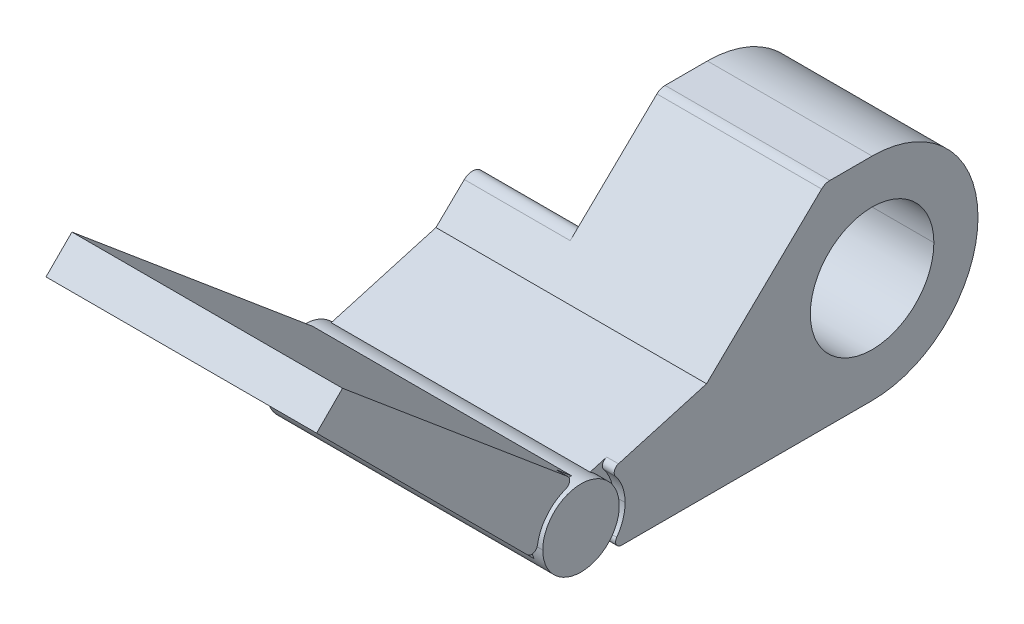
ISO-10303-21;
HEADER;
FILE_DESCRIPTION(('STEP AP214'),'2;1');
FILE_NAME('part.step','',(''),(''),'','','');
FILE_SCHEMA(('AUTOMOTIVE_DESIGN { 1 0 10303 214 1 1 1 1 }'));
ENDSEC;
DATA;
#1=APPLICATION_CONTEXT('core data for automotive mechanical design processes');
#2=APPLICATION_PROTOCOL_DEFINITION('international standard','automotive_design',2000,#1);
#3=PRODUCT_CONTEXT('',#1,'mechanical');
#4=PRODUCT('Part','Part','',(#3));
#5=PRODUCT_RELATED_PRODUCT_CATEGORY('part','',(#4));
#6=PRODUCT_DEFINITION_FORMATION('','',#4);
#7=PRODUCT_DEFINITION_CONTEXT('part definition',#1,'design');
#8=PRODUCT_DEFINITION('design','',#6,#7);
#9=PRODUCT_DEFINITION_SHAPE('','',#8);
#10=(LENGTH_UNIT() NAMED_UNIT(*) SI_UNIT(.MILLI.,.METRE.));
#11=(NAMED_UNIT(*) PLANE_ANGLE_UNIT() SI_UNIT($,.RADIAN.));
#12=(NAMED_UNIT(*) SI_UNIT($,.STERADIAN.) SOLID_ANGLE_UNIT());
#13=UNCERTAINTY_MEASURE_WITH_UNIT(LENGTH_MEASURE(1.E-05),#10,'distance_accuracy_value','');
#14=(GEOMETRIC_REPRESENTATION_CONTEXT(3) GLOBAL_UNCERTAINTY_ASSIGNED_CONTEXT((#13)) GLOBAL_UNIT_ASSIGNED_CONTEXT((#10,
#11,#12)) REPRESENTATION_CONTEXT('',''));
#15=CARTESIAN_POINT('',(0.,0.,0.));
#16=DIRECTION('',(0.,0.,1.));
#17=DIRECTION('',(1.,0.,0.));
#18=AXIS2_PLACEMENT_3D('',#15,#16,#17);
#19=CARTESIAN_POINT('',(23.,17.,3.59597377416485));
#20=DIRECTION('',(-1.,0.,0.));
#21=DIRECTION('',(0.,0.,1.));
#22=AXIS2_PLACEMENT_3D('',#19,#20,#21);
#23=CYLINDRICAL_SURFACE('',#22,1.);
#24=CARTESIAN_POINT('',(23.,17.,3.59597377416485));
#25=DIRECTION('',(1.,0.,0.));
#26=DIRECTION('',(0.,0.,-1.));
#27=AXIS2_PLACEMENT_3D('',#24,#25,#26);
#28=CIRCLE('',#27,1.);
#29=CARTESIAN_POINT('',(23.,18.,3.59597377416485));
#30=VERTEX_POINT('',#29);
#31=CARTESIAN_POINT('',(23.,17.7193398003386,4.29063214462384));
#32=VERTEX_POINT('',#31);
#33=EDGE_CURVE('E328',#30,#32,#28,.T.);
#34=ORIENTED_EDGE('',*,*,#33,.F.);
#35=DIRECTION('',(1.,0.,0.));
#36=VECTOR('',#35,1.);
#37=CARTESIAN_POINT('',(23.,18.,3.59597377416485));
#38=LINE('',#37,#36);
#39=CARTESIAN_POINT('',(9.,18.,3.59597377416485));
#40=VERTEX_POINT('',#39);
#41=EDGE_CURVE('E350',#40,#30,#38,.T.);
#42=ORIENTED_EDGE('',*,*,#41,.F.);
#43=CARTESIAN_POINT('',(9.,17.,3.59597377416485));
#44=DIRECTION('',(-1.,0.,0.));
#45=DIRECTION('',(0.,0.,1.));
#46=AXIS2_PLACEMENT_3D('',#43,#44,#45);
#47=CIRCLE('',#46,1.);
#48=CARTESIAN_POINT('',(9.,17.7193398003386,4.29063214462385));
#49=VERTEX_POINT('',#48);
#50=EDGE_CURVE('E540',#49,#40,#47,.T.);
#51=ORIENTED_EDGE('',*,*,#50,.F.);
#52=DIRECTION('',(-1.,0.,0.));
#53=VECTOR('',#52,1.);
#54=CARTESIAN_POINT('',(23.,17.7193398003386,4.29063214462384));
#55=LINE('',#54,#53);
#56=EDGE_CURVE('E413',#32,#49,#55,.T.);
#57=ORIENTED_EDGE('',*,*,#56,.F.);
#58=EDGE_LOOP('',(#34,#42,#51,#57));
#59=FACE_BOUND('',#58,.T.);
#60=ADVANCED_FACE('F14',(#59),#23,.T.);
#61=CARTESIAN_POINT('',(22.,0.5,21.302643481786));
#62=DIRECTION('',(1.,0.,0.));
#63=DIRECTION('',(0.,0.,-1.));
#64=AXIS2_PLACEMENT_3D('',#61,#62,#63);
#65=CYLINDRICAL_SURFACE('',#64,0.5);
#66=CARTESIAN_POINT('',(22.,0.5,21.302643481786));
#67=DIRECTION('',(-1.,0.,0.));
#68=DIRECTION('',(0.,0.,-1.));
#69=AXIS2_PLACEMENT_3D('',#66,#67,#68);
#70=CIRCLE('',#69,0.5);
#71=CARTESIAN_POINT('',(22.,0.,21.302643481786));
#72=VERTEX_POINT('',#71);
#73=CARTESIAN_POINT('',(22.,0.793724262730775,21.7072742486381));
#74=VERTEX_POINT('',#73);
#75=EDGE_CURVE('E272',#72,#74,#70,.T.);
#76=ORIENTED_EDGE('',*,*,#75,.F.);
#77=DIRECTION('',(-1.,0.,0.));
#78=VECTOR('',#77,1.);
#79=CARTESIAN_POINT('',(22.,0.,21.302643481786));
#80=LINE('',#79,#78);
#81=CARTESIAN_POINT('',(23.,0.,21.302643481786));
#82=VERTEX_POINT('',#81);
#83=EDGE_CURVE('E423',#82,#72,#80,.T.);
#84=ORIENTED_EDGE('',*,*,#83,.F.);
#85=CARTESIAN_POINT('',(23.,0.5,21.302643481786));
#86=DIRECTION('',(1.,0.,0.));
#87=DIRECTION('',(0.,0.,-1.));
#88=AXIS2_PLACEMENT_3D('',#85,#86,#87);
#89=CIRCLE('',#88,0.5);
#90=CARTESIAN_POINT('',(23.,0.793724262730775,21.7072742486381));
#91=VERTEX_POINT('',#90);
#92=EDGE_CURVE('E429',#91,#82,#89,.T.);
#93=ORIENTED_EDGE('',*,*,#92,.F.);
#94=DIRECTION('',(1.,0.,0.));
#95=VECTOR('',#94,1.);
#96=CARTESIAN_POINT('',(22.,0.793724262730776,21.7072742486381));
#97=LINE('',#96,#95);
#98=EDGE_CURVE('E276',#74,#91,#97,.T.);
#99=ORIENTED_EDGE('',*,*,#98,.F.);
#100=EDGE_LOOP('',(#76,#84,#93,#99));
#101=FACE_BOUND('',#100,.T.);
#102=ADVANCED_FACE('F669',(#101),#65,.T.);
#103=CARTESIAN_POINT('',(22.,5.64730748684892,21.4198749707261));
#104=DIRECTION('',(1.,0.,0.));
#105=DIRECTION('',(0.,0.,-1.));
#106=AXIS2_PLACEMENT_3D('',#103,#104,#105);
#107=CYLINDRICAL_SURFACE('',#106,0.5);
#108=CARTESIAN_POINT('',(22.,5.64730748684892,21.4198749707261));
#109=DIRECTION('',(-1.,0.,0.));
#110=DIRECTION('',(0.,0.,-1.));
#111=AXIS2_PLACEMENT_3D('',#108,#109,#110);
#112=CIRCLE('',#111,0.5);
#113=CARTESIAN_POINT('',(22.,5.33546616289159,21.8107137977028));
#114=VERTEX_POINT('',#113);
#115=CARTESIAN_POINT('',(22.,6.12793833481808,21.5576936486347));
#116=VERTEX_POINT('',#115);
#117=EDGE_CURVE('E392',#114,#116,#112,.T.);
#118=ORIENTED_EDGE('',*,*,#117,.F.);
#119=DIRECTION('',(-1.,0.,0.));
#120=VECTOR('',#119,1.);
#121=CARTESIAN_POINT('',(22.,5.33546616289159,21.8107137977028));
#122=LINE('',#121,#120);
#123=CARTESIAN_POINT('',(23.,5.33546616289159,21.8107137977028));
#124=VERTEX_POINT('',#123);
#125=EDGE_CURVE('E293',#124,#114,#122,.T.);
#126=ORIENTED_EDGE('',*,*,#125,.F.);
#127=CARTESIAN_POINT('',(23.,5.64730748684892,21.4198749707261));
#128=DIRECTION('',(1.,0.,0.));
#129=DIRECTION('',(0.,0.,-1.));
#130=AXIS2_PLACEMENT_3D('',#127,#128,#129);
#131=CIRCLE('',#130,0.5);
#132=CARTESIAN_POINT('',(23.,6.12793833481808,21.5576936486347));
#133=VERTEX_POINT('',#132);
#134=EDGE_CURVE('E332',#133,#124,#131,.T.);
#135=ORIENTED_EDGE('',*,*,#134,.F.);
#136=DIRECTION('',(1.,0.,0.));
#137=VECTOR('',#136,1.);
#138=CARTESIAN_POINT('',(23.,6.12793833481808,21.5576936486347));
#139=LINE('',#138,#137);
#140=EDGE_CURVE('E422',#116,#133,#139,.T.);
#141=ORIENTED_EDGE('',*,*,#140,.F.);
#142=EDGE_LOOP('',(#118,#126,#135,#141));
#143=FACE_BOUND('',#142,.T.);
#144=ADVANCED_FACE('F675',(#143),#107,.T.);
#145=CARTESIAN_POINT('',(22.,3.64878220999846,28.9416754288119));
#146=DIRECTION('',(1.,0.,0.));
#147=DIRECTION('',(0.,0.,-1.));
#148=AXIS2_PLACEMENT_3D('',#145,#146,#147);
#149=CYLINDRICAL_SURFACE('',#148,0.5);
#150=CARTESIAN_POINT('',(23.,3.64878220999846,28.9416754288119));
#151=DIRECTION('',(1.,0.,0.));
#152=DIRECTION('',(0.,0.,-1.));
#153=AXIS2_PLACEMENT_3D('',#150,#151,#152);
#154=CIRCLE('',#153,0.5);
#155=CARTESIAN_POINT('',(23.,3.29522881940518,29.2952288194051));
#156=VERTEX_POINT('',#155);
#157=CARTESIAN_POINT('',(23.,3.57206150684706,28.4475965548373));
#158=VERTEX_POINT('',#157);
#159=EDGE_CURVE('E377',#156,#158,#154,.T.);
#160=ORIENTED_EDGE('',*,*,#159,.F.);
#161=DIRECTION('',(1.,0.,0.));
#162=VECTOR('',#161,1.);
#163=CARTESIAN_POINT('',(23.,3.29522881940518,29.2952288194051));
#164=LINE('',#163,#162);
#165=CARTESIAN_POINT('',(22.,3.29522881940518,29.2952288194051));
#166=VERTEX_POINT('',#165);
#167=EDGE_CURVE('E505',#166,#156,#164,.T.);
#168=ORIENTED_EDGE('',*,*,#167,.F.);
#169=CARTESIAN_POINT('',(22.,3.64878220999846,28.9416754288119));
#170=DIRECTION('',(-1.,0.,0.));
#171=DIRECTION('',(0.,0.,-1.));
#172=AXIS2_PLACEMENT_3D('',#169,#170,#171);
#173=CIRCLE('',#172,0.5);
#174=CARTESIAN_POINT('',(22.,3.57206150684706,28.4475965548373));
#175=VERTEX_POINT('',#174);
#176=EDGE_CURVE('E9',#175,#166,#173,.T.);
#177=ORIENTED_EDGE('',*,*,#176,.F.);
#178=DIRECTION('',(-1.,0.,0.));
#179=VECTOR('',#178,1.);
#180=CARTESIAN_POINT('',(22.,3.57206150684706,28.4475965548373));
#181=LINE('',#180,#179);
#182=EDGE_CURVE('E391',#158,#175,#181,.T.);
#183=ORIENTED_EDGE('',*,*,#182,.F.);
#184=EDGE_LOOP('',(#160,#168,#177,#183));
#185=FACE_BOUND('',#184,.T.);
#186=ADVANCED_FACE('F688',(#185),#149,.T.);
#187=CARTESIAN_POINT('',(22.,6.98529548453996,26.2094030110542));
#188=DIRECTION('',(1.,0.,0.));
#189=DIRECTION('',(0.,0.,-1.));
#190=AXIS2_PLACEMENT_3D('',#187,#188,#189);
#191=CYLINDRICAL_SURFACE('',#190,0.5);
#192=DIRECTION('',(1.,0.,0.));
#193=VECTOR('',#192,1.);
#194=CARTESIAN_POINT('',(22.,6.98529548453996,25.7094030110542));
#195=LINE('',#194,#193);
#196=CARTESIAN_POINT('',(22.,6.98529548453996,25.7094030110542));
#197=VERTEX_POINT('',#196);
#198=CARTESIAN_POINT('',(23.,6.98529548453996,25.7094030110542));
#199=VERTEX_POINT('',#198);
#200=EDGE_CURVE('E440',#197,#199,#195,.T.);
#201=ORIENTED_EDGE('',*,*,#200,.F.);
#202=CARTESIAN_POINT('',(22.,6.98529548453996,26.2094030110542));
#203=DIRECTION('',(-1.,0.,0.));
#204=DIRECTION('',(0.,0.,-1.));
#205=AXIS2_PLACEMENT_3D('',#202,#203,#204);
#206=CIRCLE('',#205,0.5);
#207=CARTESIAN_POINT('',(22.,7.36831770609945,25.8880092062109));
#208=VERTEX_POINT('',#207);
#209=EDGE_CURVE('E25',#208,#197,#206,.T.);
#210=ORIENTED_EDGE('',*,*,#209,.F.);
#211=DIRECTION('',(-1.,0.,0.));
#212=VECTOR('',#211,1.);
#213=CARTESIAN_POINT('',(22.,7.36831770609945,25.8880092062109));
#214=LINE('',#213,#212);
#215=CARTESIAN_POINT('',(23.,7.36831770609944,25.8880092062109));
#216=VERTEX_POINT('',#215);
#217=EDGE_CURVE('E433',#216,#208,#214,.T.);
#218=ORIENTED_EDGE('',*,*,#217,.F.);
#219=CARTESIAN_POINT('',(23.,6.98529548453996,26.2094030110542));
#220=DIRECTION('',(1.,0.,0.));
#221=DIRECTION('',(0.,0.,-1.));
#222=AXIS2_PLACEMENT_3D('',#219,#220,#221);
#223=CIRCLE('',#222,0.5);
#224=EDGE_CURVE('E343',#199,#216,#223,.T.);
#225=ORIENTED_EDGE('',*,*,#224,.F.);
#226=EDGE_LOOP('',(#201,#210,#218,#225));
#227=FACE_BOUND('',#226,.T.);
#228=ADVANCED_FACE('F690',(#227),#191,.T.);
#229=CARTESIAN_POINT('',(22.,2.99665623321162,24.7420050000283));
#230=DIRECTION('',(1.,0.,0.));
#231=DIRECTION('',(0.,1.,0.));
#232=AXIS2_PLACEMENT_3D('',#229,#230,#231);
#233=PLANE('',#232);
#234=DIRECTION('',(0.,-0.642787609686543,-0.766044443118975));
#235=VECTOR('',#234,1.);
#236=CARTESIAN_POINT('',(22.,-8.42344976404674,7.06811359025203));
#237=LINE('',#236,#235);
#238=CARTESIAN_POINT('',(22.,6.24062355295245,24.5440756478505));
#239=VERTEX_POINT('',#238);
#240=EDGE_CURVE('E317',#208,#239,#237,.T.);
#241=ORIENTED_EDGE('',*,*,#240,.F.);
#242=ORIENTED_EDGE('',*,*,#209,.T.);
#243=CARTESIAN_POINT('',(22.,6.98529548453996,26.2094030110542));
#244=DIRECTION('',(-1.,0.,0.));
#245=DIRECTION('',(0.,0.,-1.));
#246=AXIS2_PLACEMENT_3D('',#243,#244,#245);
#247=CIRCLE('',#246,0.5);
#248=CARTESIAN_POINT('',(22.,6.5160438079131,26.0367679509335));
#249=VERTEX_POINT('',#248);
#250=EDGE_CURVE('E18',#197,#249,#247,.T.);
#251=ORIENTED_EDGE('',*,*,#250,.T.);
#252=CARTESIAN_POINT('',(22.,2.99665623321162,24.7420050000283));
#253=DIRECTION('',(1.,0.,0.));
#254=DIRECTION('',(0.,0.,-1.));
#255=AXIS2_PLACEMENT_3D('',#252,#253,#254);
#256=CIRCLE('',#255,3.75);
#257=EDGE_CURVE('E387',#249,#175,#256,.T.);
#258=ORIENTED_EDGE('',*,*,#257,.T.);
#259=ORIENTED_EDGE('',*,*,#176,.T.);
#260=DIRECTION('',(0.,0.707106781186549,0.707106781186546));
#261=VECTOR('',#260,1.);
#262=CARTESIAN_POINT('',(22.,-13.,13.));
#263=LINE('',#262,#261);
#264=CARTESIAN_POINT('',(22.,1.73866123323988,27.7386612332399));
#265=VERTEX_POINT('',#264);
#266=EDGE_CURVE('E504',#265,#166,#263,.T.);
#267=ORIENTED_EDGE('',*,*,#266,.F.);
#268=CARTESIAN_POINT('',(22.,2.99665623321162,24.7420050000283));
#269=DIRECTION('',(1.,0.,0.));
#270=DIRECTION('',(0.,0.,-1.));
#271=AXIS2_PLACEMENT_3D('',#268,#269,#270);
#272=CIRCLE('',#271,3.25);
#273=CARTESIAN_POINT('',(22.,2.99665623321162,27.9920050000283));
#274=VERTEX_POINT('',#273);
#275=EDGE_CURVE('E380',#274,#265,#272,.T.);
#276=ORIENTED_EDGE('',*,*,#275,.F.);
#277=CARTESIAN_POINT('',(22.,2.99665623321162,24.7420050000283));
#278=DIRECTION('',(1.,0.,0.));
#279=DIRECTION('',(0.,0.,-1.));
#280=AXIS2_PLACEMENT_3D('',#277,#278,#279);
#281=CIRCLE('',#280,3.25);
#282=EDGE_CURVE('E512',#239,#274,#281,.T.);
#283=ORIENTED_EDGE('',*,*,#282,.F.);
#284=EDGE_LOOP('',(#241,#242,#251,#258,#259,#267,#276,#283));
#285=FACE_BOUND('',#284,.T.);
#286=ADVANCED_FACE('F715',(#285),#233,.T.);
#287=CARTESIAN_POINT('',(22.,2.99665623321162,24.7420050000283));
#288=DIRECTION('',(1.,0.,0.));
#289=DIRECTION('',(0.,0.,-1.));
#290=AXIS2_PLACEMENT_3D('',#287,#288,#289);
#291=CYLINDRICAL_SURFACE('',#290,3.75);
#292=ORIENTED_EDGE('',*,*,#257,.F.);
#293=DIRECTION('',(1.,0.,0.));
#294=VECTOR('',#293,1.);
#295=CARTESIAN_POINT('',(22.,6.5160438079131,26.0367679509335));
#296=LINE('',#295,#294);
#297=CARTESIAN_POINT('',(23.,6.5160438079131,26.0367679509335));
#298=VERTEX_POINT('',#297);
#299=EDGE_CURVE('E295',#249,#298,#296,.T.);
#300=ORIENTED_EDGE('',*,*,#299,.T.);
#301=CARTESIAN_POINT('',(23.,2.99665623321162,24.7420050000283));
#302=DIRECTION('',(1.,0.,0.));
#303=DIRECTION('',(0.,0.,-1.));
#304=AXIS2_PLACEMENT_3D('',#301,#302,#303);
#305=CIRCLE('',#304,3.75);
#306=EDGE_CURVE('E339',#298,#158,#305,.T.);
#307=ORIENTED_EDGE('',*,*,#306,.T.);
#308=ORIENTED_EDGE('',*,*,#182,.T.);
#309=EDGE_LOOP('',(#292,#300,#307,#308));
#310=FACE_BOUND('',#309,.T.);
#311=ADVANCED_FACE('F703',(#310),#291,.F.);
#312=CARTESIAN_POINT('',(22.,2.99665623321162,24.7420050000283));
#313=DIRECTION('',(1.,0.,0.));
#314=DIRECTION('',(0.,1.,0.));
#315=AXIS2_PLACEMENT_3D('',#312,#313,#314);
#316=PLANE('',#315);
#317=DIRECTION('',(0.,-0.275637355817,0.961261695938319));
#318=VECTOR('',#317,1.);
#319=CARTESIAN_POINT('',(22.,11.3742809649369,3.26152258301993));
#320=LINE('',#319,#318);
#321=CARTESIAN_POINT('',(22.,5.7223893692874,22.9720109687111));
#322=VERTEX_POINT('',#321);
#323=EDGE_CURVE('E587',#116,#322,#320,.T.);
#324=ORIENTED_EDGE('',*,*,#323,.T.);
#325=CARTESIAN_POINT('',(22.,2.99665623321162,24.7420050000283));
#326=DIRECTION('',(1.,0.,0.));
#327=DIRECTION('',(0.,0.,-1.));
#328=AXIS2_PLACEMENT_3D('',#325,#326,#327);
#329=CIRCLE('',#328,3.25);
#330=CARTESIAN_POINT('',(22.,2.99665623321162,21.4920050000283));
#331=VERTEX_POINT('',#330);
#332=EDGE_CURVE('E366',#331,#322,#329,.T.);
#333=ORIENTED_EDGE('',*,*,#332,.F.);
#334=CARTESIAN_POINT('',(22.,2.99665623321162,24.7420050000283));
#335=DIRECTION('',(1.,0.,0.));
#336=DIRECTION('',(0.,0.,-1.));
#337=AXIS2_PLACEMENT_3D('',#334,#335,#336);
#338=CIRCLE('',#337,3.25);
#339=CARTESIAN_POINT('',(22.,0.,23.4840100000565));
#340=VERTEX_POINT('',#339);
#341=EDGE_CURVE('E320',#340,#331,#338,.T.);
#342=ORIENTED_EDGE('',*,*,#341,.F.);
#343=DIRECTION('',(0.,0.,1.));
#344=VECTOR('',#343,1.);
#345=CARTESIAN_POINT('',(22.,0.,0.));
#346=LINE('',#345,#344);
#347=EDGE_CURVE('E427',#72,#340,#346,.T.);
#348=ORIENTED_EDGE('',*,*,#347,.F.);
#349=ORIENTED_EDGE('',*,*,#75,.T.);
#350=CARTESIAN_POINT('',(22.,2.99665623321162,24.7420050000283));
#351=DIRECTION('',(1.,0.,0.));
#352=DIRECTION('',(0.,0.,-1.));
#353=AXIS2_PLACEMENT_3D('',#350,#351,#352);
#354=CIRCLE('',#353,3.75);
#355=CARTESIAN_POINT('',(22.,2.99665623321162,20.9920050000283));
#356=VERTEX_POINT('',#355);
#357=EDGE_CURVE('E265',#74,#356,#354,.T.);
#358=ORIENTED_EDGE('',*,*,#357,.T.);
#359=CARTESIAN_POINT('',(22.,2.99665623321162,24.7420050000283));
#360=DIRECTION('',(1.,0.,0.));
#361=DIRECTION('',(0.,0.,-1.));
#362=AXIS2_PLACEMENT_3D('',#359,#360,#361);
#363=CIRCLE('',#362,3.75);
#364=EDGE_CURVE('E269',#356,#114,#363,.T.);
#365=ORIENTED_EDGE('',*,*,#364,.T.);
#366=ORIENTED_EDGE('',*,*,#117,.T.);
#367=EDGE_LOOP('',(#324,#333,#342,#348,#349,#358,#365,#366));
#368=FACE_BOUND('',#367,.T.);
#369=ADVANCED_FACE('F267',(#368),#316,.T.);
#370=CARTESIAN_POINT('',(22.,2.99665623321162,24.7420050000283));
#371=DIRECTION('',(1.,0.,0.));
#372=DIRECTION('',(0.,0.,-1.));
#373=AXIS2_PLACEMENT_3D('',#370,#371,#372);
#374=CYLINDRICAL_SURFACE('',#373,3.75);
#375=DIRECTION('',(1.,0.,0.));
#376=VECTOR('',#375,1.);
#377=CARTESIAN_POINT('',(22.,2.99665623321162,20.9920050000283));
#378=LINE('',#377,#376);
#379=CARTESIAN_POINT('',(23.,2.99665623321162,20.9920050000283));
#380=VERTEX_POINT('',#379);
#381=EDGE_CURVE('E280',#356,#380,#378,.T.);
#382=ORIENTED_EDGE('',*,*,#381,.F.);
#383=ORIENTED_EDGE('',*,*,#357,.F.);
#384=ORIENTED_EDGE('',*,*,#98,.T.);
#385=CARTESIAN_POINT('',(23.,2.99665623321162,24.7420050000283));
#386=DIRECTION('',(1.,0.,0.));
#387=DIRECTION('',(0.,0.,-1.));
#388=AXIS2_PLACEMENT_3D('',#385,#386,#387);
#389=CIRCLE('',#388,3.75);
#390=EDGE_CURVE('E283',#91,#380,#389,.T.);
#391=ORIENTED_EDGE('',*,*,#390,.T.);
#392=EDGE_LOOP('',(#382,#383,#384,#391));
#393=FACE_BOUND('',#392,.T.);
#394=ADVANCED_FACE('F281',(#393),#374,.F.);
#395=CARTESIAN_POINT('',(-0.5,2.99665623321162,24.7420050000283));
#396=DIRECTION('',(-1.,0.,0.));
#397=DIRECTION('',(0.,0.,1.));
#398=AXIS2_PLACEMENT_3D('',#395,#396,#397);
#399=PLANE('',#398);
#400=CARTESIAN_POINT('',(-0.5,2.99665623321162,24.7420050000283));
#401=DIRECTION('',(-1.,0.,0.));
#402=DIRECTION('',(0.,0.,1.));
#403=AXIS2_PLACEMENT_3D('',#400,#401,#402);
#404=CIRCLE('',#403,3.25);
#405=CARTESIAN_POINT('',(-0.5,2.99665623321162,27.9920050000283));
#406=VERTEX_POINT('',#405);
#407=CARTESIAN_POINT('',(-0.5,2.99665623321162,21.4920050000283));
#408=VERTEX_POINT('',#407);
#409=EDGE_CURVE('E498',#406,#408,#404,.T.);
#410=ORIENTED_EDGE('',*,*,#409,.T.);
#411=CARTESIAN_POINT('',(-0.5,2.99665623321162,24.7420050000283));
#412=DIRECTION('',(-1.,0.,0.));
#413=DIRECTION('',(0.,0.,1.));
#414=AXIS2_PLACEMENT_3D('',#411,#412,#413);
#415=CIRCLE('',#414,3.25);
#416=EDGE_CURVE('E321',#408,#406,#415,.T.);
#417=ORIENTED_EDGE('',*,*,#416,.T.);
#418=EDGE_LOOP('',(#410,#417));
#419=FACE_BOUND('',#418,.T.);
#420=ADVANCED_FACE('F700',(#419),#399,.T.);
#421=CARTESIAN_POINT('',(9.,9.88440397573025,10.9643891579838));
#422=DIRECTION('',(-1.,0.,0.));
#423=DIRECTION('',(0.,0.,1.));
#424=AXIS2_PLACEMENT_3D('',#421,#422,#423);
#425=CYLINDRICAL_SURFACE('',#424,1.);
#426=CARTESIAN_POINT('',(9.,9.88440397573025,10.9643891579838));
#427=DIRECTION('',(1.,0.,0.));
#428=DIRECTION('',(0.,0.,1.));
#429=AXIS2_PLACEMENT_3D('',#426,#427,#428);
#430=CIRCLE('',#429,1.);
#431=CARTESIAN_POINT('',(9.,9.80400361430023,9.96762650725799));
#432=VERTEX_POINT('',#431);
#433=CARTESIAN_POINT('',(9.,10.6037437760689,11.6590475284428));
#434=VERTEX_POINT('',#433);
#435=EDGE_CURVE('E277',#432,#434,#430,.T.);
#436=ORIENTED_EDGE('',*,*,#435,.F.);
#437=DIRECTION('',(1.,0.,0.));
#438=VECTOR('',#437,1.);
#439=CARTESIAN_POINT('',(9.,9.80400361430023,9.96762650725799));
#440=LINE('',#439,#438);
#441=CARTESIAN_POINT('',(0.,9.80400361430023,9.96762650725799));
#442=VERTEX_POINT('',#441);
#443=EDGE_CURVE('E381',#442,#432,#440,.T.);
#444=ORIENTED_EDGE('',*,*,#443,.F.);
#445=CARTESIAN_POINT('',(0.,9.88440397573025,10.9643891579838));
#446=DIRECTION('',(-1.,0.,0.));
#447=DIRECTION('',(0.,0.,-1.));
#448=AXIS2_PLACEMENT_3D('',#445,#446,#447);
#449=CIRCLE('',#448,1.);
#450=CARTESIAN_POINT('',(0.,10.6037437760689,11.6590475284428));
#451=VERTEX_POINT('',#450);
#452=EDGE_CURVE('E453',#451,#442,#449,.T.);
#453=ORIENTED_EDGE('',*,*,#452,.F.);
#454=DIRECTION('',(-1.,0.,0.));
#455=VECTOR('',#454,1.);
#456=CARTESIAN_POINT('',(23.,10.6037437760689,11.6590475284428));
#457=LINE('',#456,#455);
#458=EDGE_CURVE('E333',#434,#451,#457,.T.);
#459=ORIENTED_EDGE('',*,*,#458,.F.);
#460=EDGE_LOOP('',(#436,#444,#453,#459));
#461=FACE_BOUND('',#460,.T.);
#462=ADVANCED_FACE('F687',(#461),#425,.T.);
#463=CARTESIAN_POINT('',(9.,1.,7.54983443527075));
#464=DIRECTION('',(-1.,0.,0.));
#465=DIRECTION('',(0.,0.,1.));
#466=AXIS2_PLACEMENT_3D('',#463,#464,#465);
#467=CYLINDRICAL_SURFACE('',#466,1.);
#468=CARTESIAN_POINT('',(9.,1.,7.54983443527075));
#469=DIRECTION('',(1.,0.,0.));
#470=DIRECTION('',(0.,0.,1.));
#471=AXIS2_PLACEMENT_3D('',#468,#469,#470);
#472=CIRCLE('',#471,1.);
#473=CARTESIAN_POINT('',(9.,0.,7.54983443527075));
#474=VERTEX_POINT('',#473);
#475=CARTESIAN_POINT('',(9.,1.72727272727273,6.86348585024614));
#476=VERTEX_POINT('',#475);
#477=EDGE_CURVE('E537',#474,#476,#472,.T.);
#478=ORIENTED_EDGE('',*,*,#477,.F.);
#479=DIRECTION('',(1.,0.,0.));
#480=VECTOR('',#479,1.);
#481=CARTESIAN_POINT('',(9.,0.,7.54983443527075));
#482=LINE('',#481,#480);
#483=CARTESIAN_POINT('',(0.,0.,7.54983443527075));
#484=VERTEX_POINT('',#483);
#485=EDGE_CURVE('E170',#484,#474,#482,.T.);
#486=ORIENTED_EDGE('',*,*,#485,.F.);
#487=CARTESIAN_POINT('',(0.,1.,7.54983443527075));
#488=DIRECTION('',(-1.,0.,0.));
#489=DIRECTION('',(0.,0.,-1.));
#490=AXIS2_PLACEMENT_3D('',#487,#488,#489);
#491=CIRCLE('',#490,1.);
#492=CARTESIAN_POINT('',(0.,1.72727272727273,6.86348585024614));
#493=VERTEX_POINT('',#492);
#494=EDGE_CURVE('E494',#493,#484,#491,.T.);
#495=ORIENTED_EDGE('',*,*,#494,.F.);
#496=DIRECTION('',(-1.,0.,0.));
#497=VECTOR('',#496,1.);
#498=CARTESIAN_POINT('',(9.,1.72727272727273,6.86348585024614));
#499=LINE('',#498,#497);
#500=EDGE_CURVE('E183',#476,#493,#499,.T.);
#501=ORIENTED_EDGE('',*,*,#500,.F.);
#502=EDGE_LOOP('',(#478,#486,#495,#501));
#503=FACE_BOUND('',#502,.T.);
#504=ADVANCED_FACE('F683',(#503),#467,.T.);
#505=CARTESIAN_POINT('',(9.,0.,0.));
#506=DIRECTION('',(-1.,0.,0.));
#507=DIRECTION('',(0.,0.,1.));
#508=AXIS2_PLACEMENT_3D('',#505,#506,#507);
#509=PLANE('',#508);
#510=CARTESIAN_POINT('',(9.,9.,0.));
#511=DIRECTION('',(1.,0.,0.));
#512=DIRECTION('',(0.,0.,1.));
#513=AXIS2_PLACEMENT_3D('',#510,#511,#512);
#514=CIRCLE('',#513,5.25);
#515=CARTESIAN_POINT('',(9.,9.,5.25));
#516=VERTEX_POINT('',#515);
#517=CARTESIAN_POINT('',(9.,9.,-5.25));
#518=VERTEX_POINT('',#517);
#519=EDGE_CURVE('E441',#516,#518,#514,.T.);
#520=ORIENTED_EDGE('',*,*,#519,.T.);
#521=CARTESIAN_POINT('',(9.,9.,0.));
#522=DIRECTION('',(1.,0.,0.));
#523=DIRECTION('',(0.,0.,1.));
#524=AXIS2_PLACEMENT_3D('',#521,#522,#523);
#525=CIRCLE('',#524,5.25);
#526=EDGE_CURVE('E353',#518,#516,#525,.T.);
#527=ORIENTED_EDGE('',*,*,#526,.T.);
#528=EDGE_LOOP('',(#520,#527));
#529=FACE_BOUND('',#528,.T.);
#530=DIRECTION('',(0.,0.694658370458999,-0.71933980033865));
#531=VECTOR('',#530,1.);
#532=CARTESIAN_POINT('',(9.,11.3128771243607,10.9247184497669));
#533=LINE('',#532,#531);
#534=EDGE_CURVE('E404',#434,#49,#533,.T.);
#535=ORIENTED_EDGE('',*,*,#534,.T.);
#536=ORIENTED_EDGE('',*,*,#50,.T.);
#537=DIRECTION('',(0.,0.,-1.));
#538=VECTOR('',#537,1.);
#539=CARTESIAN_POINT('',(9.,18.,0.));
#540=LINE('',#539,#538);
#541=CARTESIAN_POINT('',(9.,18.,0.));
#542=VERTEX_POINT('',#541);
#543=EDGE_CURVE('E398',#40,#542,#540,.T.);
#544=ORIENTED_EDGE('',*,*,#543,.T.);
#545=CARTESIAN_POINT('',(9.,9.,0.));
#546=DIRECTION('',(-1.,0.,0.));
#547=DIRECTION('',(0.,0.,1.));
#548=AXIS2_PLACEMENT_3D('',#545,#546,#547);
#549=CIRCLE('',#548,9.);
#550=CARTESIAN_POINT('',(9.,0.,0.));
#551=VERTEX_POINT('',#550);
#552=EDGE_CURVE('E322',#542,#551,#549,.T.);
#553=ORIENTED_EDGE('',*,*,#552,.T.);
#554=DIRECTION('',(0.,0.,1.));
#555=VECTOR('',#554,1.);
#556=CARTESIAN_POINT('',(9.,0.,0.));
#557=LINE('',#556,#555);
#558=EDGE_CURVE('E354',#551,#474,#557,.T.);
#559=ORIENTED_EDGE('',*,*,#558,.T.);
#560=ORIENTED_EDGE('',*,*,#477,.T.);
#561=CARTESIAN_POINT('',(9.,9.,0.));
#562=DIRECTION('',(-1.,0.,0.));
#563=DIRECTION('',(0.,0.,1.));
#564=AXIS2_PLACEMENT_3D('',#561,#562,#563);
#565=CIRCLE('',#564,10.);
#566=CARTESIAN_POINT('',(9.,9.,10.));
#567=VERTEX_POINT('',#566);
#568=EDGE_CURVE('E432',#476,#567,#565,.T.);
#569=ORIENTED_EDGE('',*,*,#568,.T.);
#570=CARTESIAN_POINT('',(9.,9.,0.));
#571=DIRECTION('',(-1.,0.,0.));
#572=DIRECTION('',(0.,0.,1.));
#573=AXIS2_PLACEMENT_3D('',#570,#571,#572);
#574=CIRCLE('',#573,10.);
#575=EDGE_CURVE('E334',#567,#432,#574,.T.);
#576=ORIENTED_EDGE('',*,*,#575,.T.);
#577=ORIENTED_EDGE('',*,*,#435,.T.);
#578=EDGE_LOOP('',(#535,#536,#544,#553,#559,#560,#569,#576,#577));
#579=FACE_BOUND('',#578,.T.);
#580=ADVANCED_FACE('F686',(#529,#579),#509,.T.);
#581=CARTESIAN_POINT('',(9.,9.,0.));
#582=DIRECTION('',(-1.,0.,0.));
#583=DIRECTION('',(0.,0.,1.));
#584=AXIS2_PLACEMENT_3D('',#581,#582,#583);
#585=CYLINDRICAL_SURFACE('',#584,10.);
#586=DIRECTION('',(-1.,0.,0.));
#587=VECTOR('',#586,1.);
#588=CARTESIAN_POINT('',(9.,9.,10.));
#589=LINE('',#588,#587);
#590=CARTESIAN_POINT('',(0.,9.,10.));
#591=VERTEX_POINT('',#590);
#592=EDGE_CURVE('E338',#567,#591,#589,.T.);
#593=ORIENTED_EDGE('',*,*,#592,.F.);
#594=ORIENTED_EDGE('',*,*,#568,.F.);
#595=ORIENTED_EDGE('',*,*,#500,.T.);
#596=CARTESIAN_POINT('',(0.,9.,0.));
#597=DIRECTION('',(-1.,0.,0.));
#598=DIRECTION('',(0.,0.,1.));
#599=AXIS2_PLACEMENT_3D('',#596,#597,#598);
#600=CIRCLE('',#599,10.);
#601=EDGE_CURVE('E491',#493,#591,#600,.T.);
#602=ORIENTED_EDGE('',*,*,#601,.T.);
#603=EDGE_LOOP('',(#593,#594,#595,#602));
#604=FACE_BOUND('',#603,.T.);
#605=ADVANCED_FACE('F720',(#604),#585,.F.);
#606=CARTESIAN_POINT('',(23.,0.,0.));
#607=DIRECTION('',(1.,0.,0.));
#608=DIRECTION('',(0.,1.,0.));
#609=AXIS2_PLACEMENT_3D('',#606,#607,#608);
#610=PLANE('',#609);
#611=CARTESIAN_POINT('',(23.,9.,0.));
#612=DIRECTION('',(1.,0.,0.));
#613=DIRECTION('',(0.,0.,-1.));
#614=AXIS2_PLACEMENT_3D('',#611,#612,#613);
#615=CIRCLE('',#614,5.25);
#616=CARTESIAN_POINT('',(23.,9.,5.25));
#617=VERTEX_POINT('',#616);
#618=CARTESIAN_POINT('',(23.,9.,-5.25));
#619=VERTEX_POINT('',#618);
#620=EDGE_CURVE('E457',#617,#619,#615,.T.);
#621=ORIENTED_EDGE('',*,*,#620,.F.);
#622=CARTESIAN_POINT('',(23.,9.,0.));
#623=DIRECTION('',(1.,0.,0.));
#624=DIRECTION('',(0.,0.,-1.));
#625=AXIS2_PLACEMENT_3D('',#622,#623,#624);
#626=CIRCLE('',#625,5.25);
#627=EDGE_CURVE('E349',#619,#617,#626,.T.);
#628=ORIENTED_EDGE('',*,*,#627,.F.);
#629=EDGE_LOOP('',(#621,#628));
#630=FACE_BOUND('',#629,.T.);
#631=DIRECTION('',(0.,0.,1.));
#632=VECTOR('',#631,1.);
#633=CARTESIAN_POINT('',(23.,18.,0.));
#634=LINE('',#633,#632);
#635=CARTESIAN_POINT('',(23.,18.,0.));
#636=VERTEX_POINT('',#635);
#637=EDGE_CURVE('E345',#636,#30,#634,.T.);
#638=ORIENTED_EDGE('',*,*,#637,.T.);
#639=ORIENTED_EDGE('',*,*,#33,.T.);
#640=DIRECTION('',(0.,-0.694658370458999,0.71933980033865));
#641=VECTOR('',#640,1.);
#642=CARTESIAN_POINT('',(23.,11.3128771243607,10.9247184497669));
#643=LINE('',#642,#641);
#644=CARTESIAN_POINT('',(23.,8.27478281357402,14.0707572047411));
#645=VERTEX_POINT('',#644);
#646=EDGE_CURVE('E358',#32,#645,#643,.T.);
#647=ORIENTED_EDGE('',*,*,#646,.T.);
#648=DIRECTION('',(0.,-0.275637355817,0.961261695938319));
#649=VECTOR('',#648,1.);
#650=CARTESIAN_POINT('',(23.,11.3742809649369,3.26152258301993));
#651=LINE('',#650,#649);
#652=EDGE_CURVE('E417',#645,#133,#651,.T.);
#653=ORIENTED_EDGE('',*,*,#652,.T.);
#654=ORIENTED_EDGE('',*,*,#134,.T.);
#655=CARTESIAN_POINT('',(23.,2.99665623321162,24.7420050000283));
#656=DIRECTION('',(1.,0.,0.));
#657=DIRECTION('',(0.,0.,-1.));
#658=AXIS2_PLACEMENT_3D('',#655,#656,#657);
#659=CIRCLE('',#658,3.75);
#660=EDGE_CURVE('E288',#380,#124,#659,.T.);
#661=ORIENTED_EDGE('',*,*,#660,.F.);
#662=ORIENTED_EDGE('',*,*,#390,.F.);
#663=ORIENTED_EDGE('',*,*,#92,.T.);
#664=DIRECTION('',(0.,0.,1.));
#665=VECTOR('',#664,1.);
#666=CARTESIAN_POINT('',(23.,0.,0.));
#667=LINE('',#666,#665);
#668=CARTESIAN_POINT('',(23.,0.,0.));
#669=VERTEX_POINT('',#668);
#670=EDGE_CURVE('E428',#669,#82,#667,.T.);
#671=ORIENTED_EDGE('',*,*,#670,.F.);
#672=CARTESIAN_POINT('',(23.,9.,0.));
#673=DIRECTION('',(1.,0.,0.));
#674=DIRECTION('',(0.,0.,-1.));
#675=AXIS2_PLACEMENT_3D('',#672,#673,#674);
#676=CIRCLE('',#675,9.);
#677=EDGE_CURVE('E393',#669,#636,#676,.T.);
#678=ORIENTED_EDGE('',*,*,#677,.T.);
#679=EDGE_LOOP('',(#638,#639,#647,#653,#654,#661,#662,#663,#671,#678));
#680=FACE_BOUND('',#679,.T.);
#681=ADVANCED_FACE('F709',(#630,#680),#610,.T.);
#682=CARTESIAN_POINT('',(23.,11.3128771243607,10.9247184497669));
#683=DIRECTION('',(0.,-0.71933980033865,-0.694658370458999));
#684=DIRECTION('',(0.,0.694658370458999,-0.71933980033865));
#685=AXIS2_PLACEMENT_3D('',#682,#683,#684);
#686=PLANE('',#685);
#687=ORIENTED_EDGE('',*,*,#646,.F.);
#688=ORIENTED_EDGE('',*,*,#56,.T.);
#689=ORIENTED_EDGE('',*,*,#534,.F.);
#690=ORIENTED_EDGE('',*,*,#458,.T.);
#691=DIRECTION('',(0.,-0.694658370458999,0.71933980033865));
#692=VECTOR('',#691,1.);
#693=CARTESIAN_POINT('',(0.,11.3128771243607,10.9247184497669));
#694=LINE('',#693,#692);
#695=CARTESIAN_POINT('',(0.,8.27478281357402,14.0707572047411));
#696=VERTEX_POINT('',#695);
#697=EDGE_CURVE('E376',#451,#696,#694,.T.);
#698=ORIENTED_EDGE('',*,*,#697,.T.);
#699=DIRECTION('',(-1.,0.,0.));
#700=VECTOR('',#699,1.);
#701=CARTESIAN_POINT('',(23.,8.27478281357402,14.0707572047411));
#702=LINE('',#701,#700);
#703=EDGE_CURVE('E421',#645,#696,#702,.T.);
#704=ORIENTED_EDGE('',*,*,#703,.F.);
#705=EDGE_LOOP('',(#687,#688,#689,#690,#698,#704));
#706=FACE_BOUND('',#705,.T.);
#707=ADVANCED_FACE('F705',(#706),#686,.F.);
#708=CARTESIAN_POINT('',(23.,0.,0.));
#709=DIRECTION('',(0.,-1.,0.));
#710=DIRECTION('',(0.,0.,-1.));
#711=AXIS2_PLACEMENT_3D('',#708,#709,#710);
#712=PLANE('',#711);
#713=ORIENTED_EDGE('',*,*,#670,.T.);
#714=ORIENTED_EDGE('',*,*,#83,.T.);
#715=ORIENTED_EDGE('',*,*,#347,.T.);
#716=DIRECTION('',(-1.,0.,0.));
#717=VECTOR('',#716,1.);
#718=CARTESIAN_POINT('',(23.,0.,23.4840100000565));
#719=LINE('',#718,#717);
#720=CARTESIAN_POINT('',(0.,0.,23.4840100000565));
#721=VERTEX_POINT('',#720);
#722=EDGE_CURVE('E157',#340,#721,#719,.T.);
#723=ORIENTED_EDGE('',*,*,#722,.T.);
#724=DIRECTION('',(0.,0.,1.));
#725=VECTOR('',#724,1.);
#726=CARTESIAN_POINT('',(0.,0.,0.));
#727=LINE('',#726,#725);
#728=EDGE_CURVE('E536',#484,#721,#727,.T.);
#729=ORIENTED_EDGE('',*,*,#728,.F.);
#730=ORIENTED_EDGE('',*,*,#485,.T.);
#731=ORIENTED_EDGE('',*,*,#558,.F.);
#732=DIRECTION('',(-1.,0.,0.));
#733=VECTOR('',#732,1.);
#734=CARTESIAN_POINT('',(23.,0.,0.));
#735=LINE('',#734,#733);
#736=EDGE_CURVE('E397',#669,#551,#735,.T.);
#737=ORIENTED_EDGE('',*,*,#736,.F.);
#738=EDGE_LOOP('',(#713,#714,#715,#723,#729,#730,#731,#737));
#739=FACE_BOUND('',#738,.T.);
#740=ADVANCED_FACE('F708',(#739),#712,.T.);
#741=CARTESIAN_POINT('',(23.,2.99665623321162,24.7420050000283));
#742=DIRECTION('',(-1.,0.,0.));
#743=DIRECTION('',(0.,0.,1.));
#744=AXIS2_PLACEMENT_3D('',#741,#742,#743);
#745=CYLINDRICAL_SURFACE('',#744,3.25);
#746=DIRECTION('',(-1.,0.,0.));
#747=VECTOR('',#746,1.);
#748=CARTESIAN_POINT('',(23.,2.99665623321162,21.4920050000283));
#749=LINE('',#748,#747);
#750=CARTESIAN_POINT('',(23.,2.99665623321162,21.4920050000283));
#751=VERTEX_POINT('',#750);
#752=EDGE_CURVE('E370',#751,#331,#749,.T.);
#753=ORIENTED_EDGE('',*,*,#752,.F.);
#754=CARTESIAN_POINT('',(23.,2.99665623321162,24.7420050000283));
#755=DIRECTION('',(1.,0.,0.));
#756=DIRECTION('',(0.,0.,-1.));
#757=AXIS2_PLACEMENT_3D('',#754,#755,#756);
#758=CIRCLE('',#757,3.25);
#759=CARTESIAN_POINT('',(23.,2.99665623321162,27.9920050000283));
#760=VERTEX_POINT('',#759);
#761=EDGE_CURVE('E344',#760,#751,#758,.T.);
#762=ORIENTED_EDGE('',*,*,#761,.F.);
#763=DIRECTION('',(-1.,0.,0.));
#764=VECTOR('',#763,1.);
#765=CARTESIAN_POINT('',(23.,2.99665623321162,27.9920050000283));
#766=LINE('',#765,#764);
#767=EDGE_CURVE('E461',#760,#274,#766,.T.);
#768=ORIENTED_EDGE('',*,*,#767,.T.);
#769=ORIENTED_EDGE('',*,*,#275,.T.);
#770=DIRECTION('',(-1.,0.,0.));
#771=VECTOR('',#770,1.);
#772=CARTESIAN_POINT('',(23.,1.73866123323988,27.7386612332399));
#773=LINE('',#772,#771);
#774=CARTESIAN_POINT('',(0.,1.73866123323988,27.7386612332399));
#775=VERTEX_POINT('',#774);
#776=EDGE_CURVE('E509',#265,#775,#773,.T.);
#777=ORIENTED_EDGE('',*,*,#776,.T.);
#778=CARTESIAN_POINT('',(0.,2.99665623321162,24.7420050000283));
#779=DIRECTION('',(-1.,0.,0.));
#780=DIRECTION('',(0.,0.,1.));
#781=AXIS2_PLACEMENT_3D('',#778,#779,#780);
#782=CIRCLE('',#781,3.25);
#783=CARTESIAN_POINT('',(0.,2.99665623321162,27.9920050000283));
#784=VERTEX_POINT('',#783);
#785=EDGE_CURVE('E361',#775,#784,#782,.T.);
#786=ORIENTED_EDGE('',*,*,#785,.T.);
#787=DIRECTION('',(-1.,0.,0.));
#788=VECTOR('',#787,1.);
#789=CARTESIAN_POINT('',(23.,2.99665623321162,27.9920050000283));
#790=LINE('',#789,#788);
#791=EDGE_CURVE('E553',#784,#406,#790,.T.);
#792=ORIENTED_EDGE('',*,*,#791,.T.);
#793=ORIENTED_EDGE('',*,*,#416,.F.);
#794=DIRECTION('',(-1.,0.,0.));
#795=VECTOR('',#794,1.);
#796=CARTESIAN_POINT('',(23.,2.99665623321162,21.4920050000283));
#797=LINE('',#796,#795);
#798=CARTESIAN_POINT('',(0.,2.99665623321162,21.4920050000283));
#799=VERTEX_POINT('',#798);
#800=EDGE_CURVE('E310',#799,#408,#797,.T.);
#801=ORIENTED_EDGE('',*,*,#800,.F.);
#802=CARTESIAN_POINT('',(0.,2.99665623321162,24.7420050000283));
#803=DIRECTION('',(-1.,0.,0.));
#804=DIRECTION('',(0.,0.,1.));
#805=AXIS2_PLACEMENT_3D('',#802,#803,#804);
#806=CIRCLE('',#805,3.25);
#807=EDGE_CURVE('E365',#799,#721,#806,.T.);
#808=ORIENTED_EDGE('',*,*,#807,.T.);
#809=ORIENTED_EDGE('',*,*,#722,.F.);
#810=ORIENTED_EDGE('',*,*,#341,.T.);
#811=EDGE_LOOP('',(#753,#762,#768,#769,#777,#786,#792,#793,#801,#808,#809,#810));
#812=FACE_BOUND('',#811,.T.);
#813=ADVANCED_FACE('F16',(#812),#745,.T.);
#814=CARTESIAN_POINT('',(23.,-13.,13.));
#815=DIRECTION('',(0.,-0.707106781186547,0.707106781186549));
#816=DIRECTION('',(-1.,0.,0.));
#817=AXIS2_PLACEMENT_3D('',#814,#815,#816);
#818=PLANE('',#817);
#819=ORIENTED_EDGE('',*,*,#266,.T.);
#820=ORIENTED_EDGE('',*,*,#167,.T.);
#821=DIRECTION('',(0.,0.707106781186549,0.707106781186546));
#822=VECTOR('',#821,1.);
#823=CARTESIAN_POINT('',(23.,-13.,13.));
#824=LINE('',#823,#822);
#825=CARTESIAN_POINT('',(23.,21.2132034355965,47.2132034355964));
#826=VERTEX_POINT('',#825);
#827=EDGE_CURVE('E405',#156,#826,#824,.T.);
#828=ORIENTED_EDGE('',*,*,#827,.T.);
#829=DIRECTION('',(-1.,0.,0.));
#830=VECTOR('',#829,1.);
#831=CARTESIAN_POINT('',(23.,21.2132034355965,47.2132034355964));
#832=LINE('',#831,#830);
#833=CARTESIAN_POINT('',(0.,21.2132034355965,47.2132034355964));
#834=VERTEX_POINT('',#833);
#835=EDGE_CURVE('E316',#826,#834,#832,.T.);
#836=ORIENTED_EDGE('',*,*,#835,.T.);
#837=DIRECTION('',(0.,0.707106781186549,0.707106781186546));
#838=VECTOR('',#837,1.);
#839=CARTESIAN_POINT('',(0.,-13.,13.));
#840=LINE('',#839,#838);
#841=EDGE_CURVE('E364',#775,#834,#840,.T.);
#842=ORIENTED_EDGE('',*,*,#841,.F.);
#843=ORIENTED_EDGE('',*,*,#776,.F.);
#844=EDGE_LOOP('',(#819,#820,#828,#836,#842,#843));
#845=FACE_BOUND('',#844,.T.);
#846=ADVANCED_FACE('F652',(#845),#818,.T.);
#847=CARTESIAN_POINT('',(23.,34.2132034355965,34.2132034355962));
#848=DIRECTION('',(0.,0.70710678118655,0.707106781186545));
#849=DIRECTION('',(1.,0.,0.));
#850=AXIS2_PLACEMENT_3D('',#847,#848,#849);
#851=PLANE('',#850);
#852=DIRECTION('',(0.,0.707106781186545,-0.70710678118655));
#853=VECTOR('',#852,1.);
#854=CARTESIAN_POINT('',(0.,34.2132034355965,34.2132034355962));
#855=LINE('',#854,#853);
#856=CARTESIAN_POINT('',(0.,23.4148660396895,45.0115408315033));
#857=VERTEX_POINT('',#856);
#858=EDGE_CURVE('E486',#834,#857,#855,.T.);
#859=ORIENTED_EDGE('',*,*,#858,.F.);
#860=ORIENTED_EDGE('',*,*,#835,.F.);
#861=DIRECTION('',(0.,0.707106781186545,-0.70710678118655));
#862=VECTOR('',#861,1.);
#863=CARTESIAN_POINT('',(23.,34.2132034355965,34.2132034355962));
#864=LINE('',#863,#862);
#865=CARTESIAN_POINT('',(23.,23.4148660396895,45.0115408315033));
#866=VERTEX_POINT('',#865);
#867=EDGE_CURVE('E409',#826,#866,#864,.T.);
#868=ORIENTED_EDGE('',*,*,#867,.T.);
#869=DIRECTION('',(-1.,0.,0.));
#870=VECTOR('',#869,1.);
#871=CARTESIAN_POINT('',(23.,23.4148660396895,45.0115408315033));
#872=LINE('',#871,#870);
#873=EDGE_CURVE('E313',#866,#857,#872,.T.);
#874=ORIENTED_EDGE('',*,*,#873,.T.);
#875=EDGE_LOOP('',(#859,#860,#868,#874));
#876=FACE_BOUND('',#875,.T.);
#877=ADVANCED_FACE('F655',(#876),#851,.T.);
#878=CARTESIAN_POINT('',(23.,-8.42344976404674,7.06811359025203));
#879=DIRECTION('',(0.,0.766044443118975,-0.642787609686543));
#880=DIRECTION('',(-1.,0.,0.));
#881=AXIS2_PLACEMENT_3D('',#878,#879,#880);
#882=PLANE('',#881);
#883=DIRECTION('',(0.,-0.642787609686543,-0.766044443118975));
#884=VECTOR('',#883,1.);
#885=CARTESIAN_POINT('',(23.,-8.42344976404674,7.06811359025203));
#886=LINE('',#885,#884);
#887=EDGE_CURVE('E465',#866,#216,#886,.T.);
#888=ORIENTED_EDGE('',*,*,#887,.T.);
#889=ORIENTED_EDGE('',*,*,#217,.T.);
#890=ORIENTED_EDGE('',*,*,#240,.T.);
#891=DIRECTION('',(-1.,0.,0.));
#892=VECTOR('',#891,1.);
#893=CARTESIAN_POINT('',(23.,6.24062355295245,24.5440756478505));
#894=LINE('',#893,#892);
#895=CARTESIAN_POINT('',(0.,6.24062355295245,24.5440756478505));
#896=VERTEX_POINT('',#895);
#897=EDGE_CURVE('E516',#239,#896,#894,.T.);
#898=ORIENTED_EDGE('',*,*,#897,.T.);
#899=DIRECTION('',(0.,-0.642787609686543,-0.766044443118975));
#900=VECTOR('',#899,1.);
#901=CARTESIAN_POINT('',(0.,-8.42344976404674,7.06811359025203));
#902=LINE('',#901,#900);
#903=EDGE_CURVE('E327',#857,#896,#902,.T.);
#904=ORIENTED_EDGE('',*,*,#903,.F.);
#905=ORIENTED_EDGE('',*,*,#873,.F.);
#906=EDGE_LOOP('',(#888,#889,#890,#898,#904,#905));
#907=FACE_BOUND('',#906,.T.);
#908=ADVANCED_FACE('F638',(#907),#882,.T.);
#909=CARTESIAN_POINT('',(23.,11.3742809649369,3.26152258301993));
#910=DIRECTION('',(0.,-0.961261695938318,-0.275637355817));
#911=DIRECTION('',(0.,0.275637355817,-0.961261695938318));
#912=AXIS2_PLACEMENT_3D('',#909,#910,#911);
#913=PLANE('',#912);
#914=ORIENTED_EDGE('',*,*,#323,.F.);
#915=ORIENTED_EDGE('',*,*,#140,.T.);
#916=ORIENTED_EDGE('',*,*,#652,.F.);
#917=ORIENTED_EDGE('',*,*,#703,.T.);
#918=DIRECTION('',(0.,-0.275637355817,0.961261695938319));
#919=VECTOR('',#918,1.);
#920=CARTESIAN_POINT('',(0.,11.3742809649369,3.26152258301993));
#921=LINE('',#920,#919);
#922=CARTESIAN_POINT('',(0.,5.7223893692874,22.9720109687111));
#923=VERTEX_POINT('',#922);
#924=EDGE_CURVE('E373',#696,#923,#921,.T.);
#925=ORIENTED_EDGE('',*,*,#924,.T.);
#926=DIRECTION('',(-1.,0.,0.));
#927=VECTOR('',#926,1.);
#928=CARTESIAN_POINT('',(23.,5.7223893692874,22.9720109687111));
#929=LINE('',#928,#927);
#930=EDGE_CURVE('E311',#322,#923,#929,.T.);
#931=ORIENTED_EDGE('',*,*,#930,.F.);
#932=EDGE_LOOP('',(#914,#915,#916,#917,#925,#931));
#933=FACE_BOUND('',#932,.T.);
#934=ADVANCED_FACE('F663',(#933),#913,.F.);
#935=CARTESIAN_POINT('',(23.,9.,0.));
#936=DIRECTION('',(-1.,0.,0.));
#937=DIRECTION('',(0.,0.,1.));
#938=AXIS2_PLACEMENT_3D('',#935,#936,#937);
#939=CYLINDRICAL_SURFACE('',#938,5.25);
#940=DIRECTION('',(-1.,0.,0.));
#941=VECTOR('',#940,1.);
#942=CARTESIAN_POINT('',(23.,9.,-5.25));
#943=LINE('',#942,#941);
#944=EDGE_CURVE('E446',#619,#518,#943,.T.);
#945=ORIENTED_EDGE('',*,*,#944,.F.);
#946=ORIENTED_EDGE('',*,*,#627,.T.);
#947=DIRECTION('',(-1.,0.,0.));
#948=VECTOR('',#947,1.);
#949=CARTESIAN_POINT('',(23.,9.,5.25));
#950=LINE('',#949,#948);
#951=EDGE_CURVE('E445',#617,#516,#950,.T.);
#952=ORIENTED_EDGE('',*,*,#951,.T.);
#953=ORIENTED_EDGE('',*,*,#526,.F.);
#954=EDGE_LOOP('',(#945,#946,#952,#953));
#955=FACE_BOUND('',#954,.T.);
#956=ADVANCED_FACE('F681',(#955),#939,.F.);
#957=CARTESIAN_POINT('',(23.,18.,0.));
#958=DIRECTION('',(0.,-1.,0.));
#959=DIRECTION('',(0.,0.,-1.));
#960=AXIS2_PLACEMENT_3D('',#957,#958,#959);
#961=PLANE('',#960);
#962=ORIENTED_EDGE('',*,*,#543,.F.);
#963=ORIENTED_EDGE('',*,*,#41,.T.);
#964=ORIENTED_EDGE('',*,*,#637,.F.);
#965=DIRECTION('',(-1.,0.,0.));
#966=VECTOR('',#965,1.);
#967=CARTESIAN_POINT('',(23.,18.,0.));
#968=LINE('',#967,#966);
#969=EDGE_CURVE('E326',#636,#542,#968,.T.);
#970=ORIENTED_EDGE('',*,*,#969,.T.);
#971=EDGE_LOOP('',(#962,#963,#964,#970));
#972=FACE_BOUND('',#971,.T.);
#973=ADVANCED_FACE('F734',(#972),#961,.F.);
#974=CARTESIAN_POINT('',(23.,9.,0.));
#975=DIRECTION('',(-1.,0.,0.));
#976=DIRECTION('',(0.,0.,1.));
#977=AXIS2_PLACEMENT_3D('',#974,#975,#976);
#978=CYLINDRICAL_SURFACE('',#977,9.);
#979=ORIENTED_EDGE('',*,*,#552,.F.);
#980=ORIENTED_EDGE('',*,*,#969,.F.);
#981=ORIENTED_EDGE('',*,*,#677,.F.);
#982=ORIENTED_EDGE('',*,*,#736,.T.);
#983=EDGE_LOOP('',(#979,#980,#981,#982));
#984=FACE_BOUND('',#983,.T.);
#985=ADVANCED_FACE('F732',(#984),#978,.T.);
#986=CARTESIAN_POINT('',(0.,0.,0.));
#987=DIRECTION('',(1.,0.,0.));
#988=DIRECTION('',(0.,1.,0.));
#989=AXIS2_PLACEMENT_3D('',#986,#987,#988);
#990=PLANE('',#989);
#991=ORIENTED_EDGE('',*,*,#785,.F.);
#992=ORIENTED_EDGE('',*,*,#841,.T.);
#993=ORIENTED_EDGE('',*,*,#858,.T.);
#994=ORIENTED_EDGE('',*,*,#903,.T.);
#995=CARTESIAN_POINT('',(0.,2.99665623321162,24.7420050000283));
#996=DIRECTION('',(-1.,0.,0.));
#997=DIRECTION('',(0.,0.,1.));
#998=AXIS2_PLACEMENT_3D('',#995,#996,#997);
#999=CIRCLE('',#998,3.25);
#1000=EDGE_CURVE('E544',#784,#896,#999,.T.);
#1001=ORIENTED_EDGE('',*,*,#1000,.F.);
#1002=EDGE_LOOP('',(#991,#992,#993,#994,#1001));
#1003=FACE_BOUND('',#1002,.T.);
#1004=ADVANCED_FACE('F634',(#1003),#990,.F.);
#1005=CARTESIAN_POINT('',(0.,0.,0.));
#1006=DIRECTION('',(1.,0.,0.));
#1007=DIRECTION('',(0.,1.,0.));
#1008=AXIS2_PLACEMENT_3D('',#1005,#1006,#1007);
#1009=PLANE('',#1008);
#1010=CARTESIAN_POINT('',(0.,2.99665623321162,24.7420050000283));
#1011=DIRECTION('',(-1.,0.,0.));
#1012=DIRECTION('',(0.,0.,1.));
#1013=AXIS2_PLACEMENT_3D('',#1010,#1011,#1012);
#1014=CIRCLE('',#1013,3.25);
#1015=EDGE_CURVE('E308',#923,#799,#1014,.T.);
#1016=ORIENTED_EDGE('',*,*,#1015,.F.);
#1017=ORIENTED_EDGE('',*,*,#924,.F.);
#1018=ORIENTED_EDGE('',*,*,#697,.F.);
#1019=ORIENTED_EDGE('',*,*,#452,.T.);
#1020=CARTESIAN_POINT('',(0.,9.,0.));
#1021=DIRECTION('',(-1.,0.,0.));
#1022=DIRECTION('',(0.,0.,1.));
#1023=AXIS2_PLACEMENT_3D('',#1020,#1021,#1022);
#1024=CIRCLE('',#1023,10.);
#1025=EDGE_CURVE('E386',#591,#442,#1024,.T.);
#1026=ORIENTED_EDGE('',*,*,#1025,.F.);
#1027=ORIENTED_EDGE('',*,*,#601,.F.);
#1028=ORIENTED_EDGE('',*,*,#494,.T.);
#1029=ORIENTED_EDGE('',*,*,#728,.T.);
#1030=ORIENTED_EDGE('',*,*,#807,.F.);
#1031=EDGE_LOOP('',(#1016,#1017,#1018,#1019,#1026,#1027,#1028,#1029,#1030));
#1032=FACE_BOUND('',#1031,.T.);
#1033=ADVANCED_FACE('F756',(#1032),#1009,.F.);
#1034=CARTESIAN_POINT('',(23.,0.,0.));
#1035=DIRECTION('',(1.,0.,0.));
#1036=DIRECTION('',(0.,1.,0.));
#1037=AXIS2_PLACEMENT_3D('',#1034,#1035,#1036);
#1038=PLANE('',#1037);
#1039=ORIENTED_EDGE('',*,*,#306,.F.);
#1040=CARTESIAN_POINT('',(23.,6.98529548453996,26.2094030110542));
#1041=DIRECTION('',(1.,0.,0.));
#1042=DIRECTION('',(0.,0.,-1.));
#1043=AXIS2_PLACEMENT_3D('',#1040,#1041,#1042);
#1044=CIRCLE('',#1043,0.5);
#1045=EDGE_CURVE('E303',#298,#199,#1044,.T.);
#1046=ORIENTED_EDGE('',*,*,#1045,.T.);
#1047=ORIENTED_EDGE('',*,*,#224,.T.);
#1048=ORIENTED_EDGE('',*,*,#887,.F.);
#1049=ORIENTED_EDGE('',*,*,#867,.F.);
#1050=ORIENTED_EDGE('',*,*,#827,.F.);
#1051=ORIENTED_EDGE('',*,*,#159,.T.);
#1052=EDGE_LOOP('',(#1039,#1046,#1047,#1048,#1049,#1050,#1051));
#1053=FACE_BOUND('',#1052,.T.);
#1054=ADVANCED_FACE('F695',(#1053),#1038,.T.);
#1055=CARTESIAN_POINT('',(23.,0.,0.));
#1056=DIRECTION('',(1.,0.,0.));
#1057=DIRECTION('',(0.,1.,0.));
#1058=AXIS2_PLACEMENT_3D('',#1055,#1056,#1057);
#1059=PLANE('',#1058);
#1060=ORIENTED_EDGE('',*,*,#761,.T.);
#1061=CARTESIAN_POINT('',(23.,2.99665623321162,24.7420050000283));
#1062=DIRECTION('',(1.,0.,0.));
#1063=DIRECTION('',(0.,0.,-1.));
#1064=AXIS2_PLACEMENT_3D('',#1061,#1062,#1063);
#1065=CIRCLE('',#1064,3.25);
#1066=EDGE_CURVE('E385',#751,#760,#1065,.T.);
#1067=ORIENTED_EDGE('',*,*,#1066,.T.);
#1068=EDGE_LOOP('',(#1060,#1067));
#1069=FACE_BOUND('',#1068,.T.);
#1070=ADVANCED_FACE('F692',(#1069),#1059,.T.);
#1071=CARTESIAN_POINT('',(23.,9.,0.));
#1072=DIRECTION('',(-1.,0.,0.));
#1073=DIRECTION('',(0.,0.,1.));
#1074=AXIS2_PLACEMENT_3D('',#1071,#1072,#1073);
#1075=CYLINDRICAL_SURFACE('',#1074,5.25);
#1076=ORIENTED_EDGE('',*,*,#620,.T.);
#1077=ORIENTED_EDGE('',*,*,#944,.T.);
#1078=ORIENTED_EDGE('',*,*,#519,.F.);
#1079=ORIENTED_EDGE('',*,*,#951,.F.);
#1080=EDGE_LOOP('',(#1076,#1077,#1078,#1079));
#1081=FACE_BOUND('',#1080,.T.);
#1082=ADVANCED_FACE('F694',(#1081),#1075,.F.);
#1083=CARTESIAN_POINT('',(23.,2.99665623321162,24.7420050000283));
#1084=DIRECTION('',(-1.,0.,0.));
#1085=DIRECTION('',(0.,0.,1.));
#1086=AXIS2_PLACEMENT_3D('',#1083,#1084,#1085);
#1087=CYLINDRICAL_SURFACE('',#1086,3.25);
#1088=ORIENTED_EDGE('',*,*,#1066,.F.);
#1089=ORIENTED_EDGE('',*,*,#752,.T.);
#1090=ORIENTED_EDGE('',*,*,#332,.T.);
#1091=ORIENTED_EDGE('',*,*,#930,.T.);
#1092=ORIENTED_EDGE('',*,*,#1015,.T.);
#1093=ORIENTED_EDGE('',*,*,#800,.T.);
#1094=ORIENTED_EDGE('',*,*,#409,.F.);
#1095=ORIENTED_EDGE('',*,*,#791,.F.);
#1096=ORIENTED_EDGE('',*,*,#1000,.T.);
#1097=ORIENTED_EDGE('',*,*,#897,.F.);
#1098=ORIENTED_EDGE('',*,*,#282,.T.);
#1099=ORIENTED_EDGE('',*,*,#767,.F.);
#1100=EDGE_LOOP('',(#1088,#1089,#1090,#1091,#1092,#1093,#1094,#1095,#1096,#1097,#1098,#1099));
#1101=FACE_BOUND('',#1100,.T.);
#1102=ADVANCED_FACE('F643',(#1101),#1087,.T.);
#1103=CARTESIAN_POINT('',(9.,9.,0.));
#1104=DIRECTION('',(-1.,0.,0.));
#1105=DIRECTION('',(0.,0.,1.));
#1106=AXIS2_PLACEMENT_3D('',#1103,#1104,#1105);
#1107=CYLINDRICAL_SURFACE('',#1106,10.);
#1108=ORIENTED_EDGE('',*,*,#575,.F.);
#1109=ORIENTED_EDGE('',*,*,#592,.T.);
#1110=ORIENTED_EDGE('',*,*,#1025,.T.);
#1111=ORIENTED_EDGE('',*,*,#443,.T.);
#1112=EDGE_LOOP('',(#1108,#1109,#1110,#1111));
#1113=FACE_BOUND('',#1112,.T.);
#1114=ADVANCED_FACE('F736',(#1113),#1107,.F.);
#1115=CARTESIAN_POINT('',(22.,2.99665623321162,24.7420050000283));
#1116=DIRECTION('',(1.,0.,0.));
#1117=DIRECTION('',(0.,0.,-1.));
#1118=AXIS2_PLACEMENT_3D('',#1115,#1116,#1117);
#1119=CYLINDRICAL_SURFACE('',#1118,3.75);
#1120=ORIENTED_EDGE('',*,*,#364,.F.);
#1121=ORIENTED_EDGE('',*,*,#381,.T.);
#1122=ORIENTED_EDGE('',*,*,#660,.T.);
#1123=ORIENTED_EDGE('',*,*,#125,.T.);
#1124=EDGE_LOOP('',(#1120,#1121,#1122,#1123));
#1125=FACE_BOUND('',#1124,.T.);
#1126=ADVANCED_FACE('F291',(#1125),#1119,.F.);
#1127=CARTESIAN_POINT('',(22.,6.98529548453996,26.2094030110542));
#1128=DIRECTION('',(1.,0.,0.));
#1129=DIRECTION('',(0.,0.,-1.));
#1130=AXIS2_PLACEMENT_3D('',#1127,#1128,#1129);
#1131=CYLINDRICAL_SURFACE('',#1130,0.5);
#1132=ORIENTED_EDGE('',*,*,#250,.F.);
#1133=ORIENTED_EDGE('',*,*,#200,.T.);
#1134=ORIENTED_EDGE('',*,*,#1045,.F.);
#1135=ORIENTED_EDGE('',*,*,#299,.F.);
#1136=EDGE_LOOP('',(#1132,#1133,#1134,#1135));
#1137=FACE_BOUND('',#1136,.T.);
#1138=ADVANCED_FACE('F743',(#1137),#1131,.T.);
#1139=CLOSED_SHELL('',(#60,#102,#144,#186,#228,#286,#311,#369,#394,#420,#462,#504,#580,#605,
#681,#707,#740,#813,#846,#877,#908,#934,#956,#973,#985,#1004,#1033,#1054,#1070,#1082,#1102,
#1114,#1126,#1138));
#1140=MANIFOLD_SOLID_BREP('B1',#1139);
#1141=ADVANCED_BREP_SHAPE_REPRESENTATION('',(#18,#1140),#14);
#1142=SHAPE_DEFINITION_REPRESENTATION(#9,#1141);
ENDSEC;
END-ISO-10303-21;
